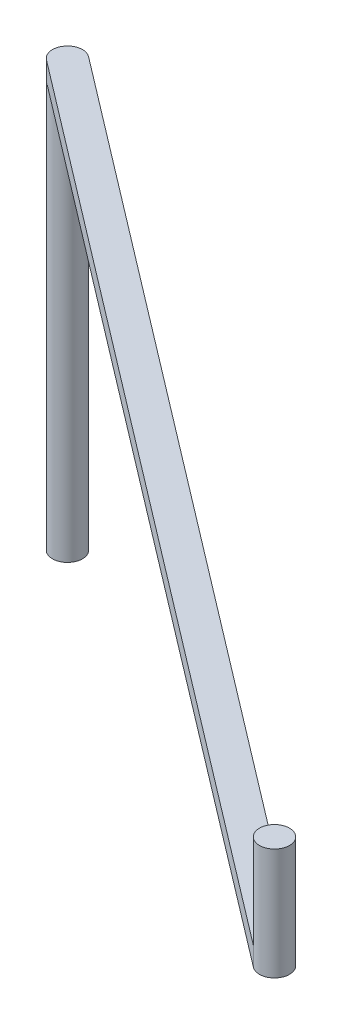
ISO-10303-21;
HEADER;
FILE_DESCRIPTION(('STEP AP214'),'2;1');
FILE_NAME('part.step','',(''),(''),'','','');
FILE_SCHEMA(('AUTOMOTIVE_DESIGN { 1 0 10303 214 1 1 1 1 }'));
ENDSEC;
DATA;
#1=APPLICATION_CONTEXT('core data for automotive mechanical design processes');
#2=APPLICATION_PROTOCOL_DEFINITION('international standard','automotive_design',2000,#1);
#3=PRODUCT_CONTEXT('',#1,'mechanical');
#4=PRODUCT('Part','Part','',(#3));
#5=PRODUCT_RELATED_PRODUCT_CATEGORY('part','',(#4));
#6=PRODUCT_DEFINITION_FORMATION('','',#4);
#7=PRODUCT_DEFINITION_CONTEXT('part definition',#1,'design');
#8=PRODUCT_DEFINITION('design','',#6,#7);
#9=PRODUCT_DEFINITION_SHAPE('','',#8);
#10=(LENGTH_UNIT() NAMED_UNIT(*) SI_UNIT(.MILLI.,.METRE.));
#11=(NAMED_UNIT(*) PLANE_ANGLE_UNIT() SI_UNIT($,.RADIAN.));
#12=(NAMED_UNIT(*) SI_UNIT($,.STERADIAN.) SOLID_ANGLE_UNIT());
#13=UNCERTAINTY_MEASURE_WITH_UNIT(LENGTH_MEASURE(1.E-05),#10,'distance_accuracy_value','');
#14=(GEOMETRIC_REPRESENTATION_CONTEXT(3) GLOBAL_UNCERTAINTY_ASSIGNED_CONTEXT((#13)) GLOBAL_UNIT_ASSIGNED_CONTEXT((#10,
#11,#12)) REPRESENTATION_CONTEXT('',''));
#15=CARTESIAN_POINT('',(0.,0.,0.));
#16=DIRECTION('',(0.,0.,1.));
#17=DIRECTION('',(1.,0.,0.));
#18=AXIS2_PLACEMENT_3D('',#15,#16,#17);
#19=CARTESIAN_POINT('',(1.67995279782915,-17.5908043356824,6.75346403648911));
#20=DIRECTION('',(0.,1.,0.));
#21=DIRECTION('',(-0.99979450619741,0.,0.0202717877228154));
#22=AXIS2_PLACEMENT_3D('',#19,#20,#21);
#23=PLANE('',#22);
#24=CARTESIAN_POINT('',(4.11481263415116,-17.5908043356824,22.3380316137882));
#25=DIRECTION('',(0.,1.,0.));
#26=DIRECTION('',(-1.,0.,0.));
#27=AXIS2_PLACEMENT_3D('',#24,#25,#26);
#28=CIRCLE('',#27,0.8);
#29=CARTESIAN_POINT('',(3.31481263415116,-17.5908043356824,22.3380316137882));
#30=VERTEX_POINT('',#29);
#31=EDGE_CURVE('E10',#30,#30,#28,.F.);
#32=ORIENTED_EDGE('',*,*,#31,.F.);
#33=EDGE_LOOP('',(#32));
#34=FACE_BOUND('',#33,.T.);
#35=ADVANCED_FACE('F16',(#34),#23,.T.);
#36=CARTESIAN_POINT('',(4.11481263415116,-17.5888043356824,22.3380316137882));
#37=DIRECTION('',(0.,-1.,0.));
#38=DIRECTION('',(1.,0.,0.));
#39=AXIS2_PLACEMENT_3D('',#36,#37,#38);
#40=CYLINDRICAL_SURFACE('',#39,0.8);
#41=CARTESIAN_POINT('',(4.11481263415116,-22.5408043356824,22.3380316137882));
#42=DIRECTION('',(0.,-1.,0.));
#43=DIRECTION('',(-0.7090944748072,0.,-0.705113484339862));
#44=AXIS2_PLACEMENT_3D('',#41,#42,#43);
#45=CIRCLE('',#44,0.8);
#46=CARTESIAN_POINT('',(3.62983961550808,-22.5408043356824,22.9742714830107));
#47=VERTEX_POINT('',#46);
#48=CARTESIAN_POINT('',(4.59978565279424,-22.5408043356824,21.7017917445657));
#49=VERTEX_POINT('',#48);
#50=EDGE_CURVE('E24',#47,#49,#45,.T.);
#51=ORIENTED_EDGE('',*,*,#50,.F.);
#52=DIRECTION('',(0.,1.,0.));
#53=VECTOR('',#52,1.);
#54=CARTESIAN_POINT('',(3.62983961550808,-23.5408043356823,22.9742714830107));
#55=LINE('',#54,#53);
#56=CARTESIAN_POINT('',(3.62983961550808,-23.5408043356823,22.9742714830107));
#57=VERTEX_POINT('',#56);
#58=EDGE_CURVE('E35',#57,#47,#55,.T.);
#59=ORIENTED_EDGE('',*,*,#58,.F.);
#60=CARTESIAN_POINT('',(4.11481263415116,-23.5408043356823,22.3380316137882));
#61=DIRECTION('',(0.,-1.,0.));
#62=DIRECTION('',(-0.7090944748072,0.,-0.705113484339862));
#63=AXIS2_PLACEMENT_3D('',#60,#61,#62);
#64=CIRCLE('',#63,0.8);
#65=CARTESIAN_POINT('',(4.59978565279424,-23.5408043356823,21.7017917445657));
#66=VERTEX_POINT('',#65);
#67=EDGE_CURVE('E73',#66,#57,#64,.T.);
#68=ORIENTED_EDGE('',*,*,#67,.F.);
#69=DIRECTION('',(0.,1.,0.));
#70=VECTOR('',#69,1.);
#71=CARTESIAN_POINT('',(4.59978565279424,-23.5408043356823,21.7017917445657));
#72=LINE('',#71,#70);
#73=EDGE_CURVE('E100',#66,#49,#72,.T.);
#74=ORIENTED_EDGE('',*,*,#73,.T.);
#75=EDGE_LOOP('',(#51,#59,#68,#74));
#76=FACE_BOUND('',#75,.T.);
#77=ORIENTED_EDGE('',*,*,#31,.T.);
#78=EDGE_LOOP('',(#77));
#79=FACE_BOUND('',#78,.T.);
#80=ADVANCED_FACE('F112',(#76,#79),#40,.T.);
#81=CARTESIAN_POINT('',(-18.9217983076755,-22.5408043356824,4.74022028454323));
#82=DIRECTION('',(0.,-1.,0.));
#83=DIRECTION('',(1.,0.,0.));
#84=AXIS2_PLACEMENT_3D('',#81,#82,#83);
#85=PLANE('',#84);
#86=DIRECTION('',(-0.795299836528086,0.,-0.606216273303843));
#87=VECTOR('',#86,1.);
#88=CARTESIAN_POINT('',(-19.564284816997,-22.5408043356824,5.29458008837741));
#89=LINE('',#88,#87);
#90=CARTESIAN_POINT('',(-42.7584092495022,-22.5408043356824,-12.3851113062559));
#91=VERTEX_POINT('',#90);
#92=EDGE_CURVE('E60',#47,#91,#89,.T.);
#93=ORIENTED_EDGE('',*,*,#92,.F.);
#94=ORIENTED_EDGE('',*,*,#50,.T.);
#95=DIRECTION('',(0.795299836528074,0.,0.606216273303859));
#96=VECTOR('',#95,1.);
#97=CARTESIAN_POINT('',(-18.5943387797105,-22.5408043356824,4.02210034993201));
#98=LINE('',#97,#96);
#99=CARTESIAN_POINT('',(-41.7884632122153,-22.5408043356824,-13.6575910447017));
#100=VERTEX_POINT('',#99);
#101=EDGE_CURVE('E95',#100,#49,#98,.T.);
#102=ORIENTED_EDGE('',*,*,#101,.F.);
#103=CARTESIAN_POINT('',(-42.2734362308587,-22.5408043356824,-13.0213511754788));
#104=DIRECTION('',(0.,-1.,0.));
#105=DIRECTION('',(1.,0.,0.));
#106=AXIS2_PLACEMENT_3D('',#103,#104,#105);
#107=CIRCLE('',#106,0.80000000000058);
#108=EDGE_CURVE('E92',#100,#91,#107,.F.);
#109=ORIENTED_EDGE('',*,*,#108,.T.);
#110=EDGE_LOOP('',(#93,#94,#102,#109));
#111=FACE_BOUND('',#110,.T.);
#112=ADVANCED_FACE('F108',(#111),#85,.F.);
#113=CARTESIAN_POINT('',(-18.5943387797105,-23.5408043356823,4.02210034993201));
#114=DIRECTION('',(-0.606216273303859,0.,0.795299836528074));
#115=DIRECTION('',(0.795299836528074,0.,0.606216273303859));
#116=AXIS2_PLACEMENT_3D('',#113,#114,#115);
#117=PLANE('',#116);
#118=ORIENTED_EDGE('',*,*,#101,.T.);
#119=ORIENTED_EDGE('',*,*,#73,.F.);
#120=DIRECTION('',(0.795299836528074,0.,0.606216273303859));
#121=VECTOR('',#120,1.);
#122=CARTESIAN_POINT('',(-18.5943387797105,-23.5408043356823,4.02210034993201));
#123=LINE('',#122,#121);
#124=CARTESIAN_POINT('',(-41.7884632122153,-23.5408043356823,-13.6575910447017));
#125=VERTEX_POINT('',#124);
#126=EDGE_CURVE('E89',#125,#66,#123,.T.);
#127=ORIENTED_EDGE('',*,*,#126,.F.);
#128=DIRECTION('',(0.,1.,0.));
#129=VECTOR('',#128,1.);
#130=CARTESIAN_POINT('',(-41.7884632122153,-23.5408043356823,-13.6575910447017));
#131=LINE('',#130,#129);
#132=EDGE_CURVE('E65',#125,#100,#131,.T.);
#133=ORIENTED_EDGE('',*,*,#132,.T.);
#134=EDGE_LOOP('',(#118,#119,#127,#133));
#135=FACE_BOUND('',#134,.T.);
#136=ADVANCED_FACE('F111',(#135),#117,.F.);
#137=CARTESIAN_POINT('',(-19.564284816997,-23.5408043356823,5.29458008837741));
#138=DIRECTION('',(0.606216273303843,0.,-0.795299836528086));
#139=DIRECTION('',(-0.795299836528086,0.,-0.606216273303843));
#140=AXIS2_PLACEMENT_3D('',#137,#138,#139);
#141=PLANE('',#140);
#142=ORIENTED_EDGE('',*,*,#92,.T.);
#143=DIRECTION('',(0.,1.,0.));
#144=VECTOR('',#143,1.);
#145=CARTESIAN_POINT('',(-42.7584092495022,-23.5408043356823,-12.3851113062559));
#146=LINE('',#145,#144);
#147=CARTESIAN_POINT('',(-42.7584092495022,-23.5408043356823,-12.3851113062559));
#148=VERTEX_POINT('',#147);
#149=EDGE_CURVE('E55',#148,#91,#146,.T.);
#150=ORIENTED_EDGE('',*,*,#149,.F.);
#151=DIRECTION('',(-0.795299836528086,0.,-0.606216273303843));
#152=VECTOR('',#151,1.);
#153=CARTESIAN_POINT('',(-19.564284816997,-23.5408043356823,5.29458008837741));
#154=LINE('',#153,#152);
#155=EDGE_CURVE('E58',#57,#148,#154,.T.);
#156=ORIENTED_EDGE('',*,*,#155,.F.);
#157=ORIENTED_EDGE('',*,*,#58,.T.);
#158=EDGE_LOOP('',(#142,#150,#156,#157));
#159=FACE_BOUND('',#158,.T.);
#160=ADVANCED_FACE('F57',(#159),#141,.F.);
#161=CARTESIAN_POINT('',(-18.9217983076755,-23.5408043356823,4.74022028454323));
#162=DIRECTION('',(0.,-1.,0.));
#163=DIRECTION('',(1.,0.,0.));
#164=AXIS2_PLACEMENT_3D('',#161,#162,#163);
#165=PLANE('',#164);
#166=CARTESIAN_POINT('',(-42.2734362308587,-23.5408043356823,-13.0213511754788));
#167=DIRECTION('',(0.,-1.,0.));
#168=DIRECTION('',(1.,0.,0.));
#169=AXIS2_PLACEMENT_3D('',#166,#167,#168);
#170=CIRCLE('',#169,0.80000000000058);
#171=EDGE_CURVE('E71',#125,#148,#170,.T.);
#172=ORIENTED_EDGE('',*,*,#171,.F.);
#173=ORIENTED_EDGE('',*,*,#126,.T.);
#174=ORIENTED_EDGE('',*,*,#67,.T.);
#175=ORIENTED_EDGE('',*,*,#155,.T.);
#176=EDGE_LOOP('',(#172,#173,#174,#175));
#177=FACE_BOUND('',#176,.T.);
#178=ADVANCED_FACE('F69',(#177),#165,.T.);
#179=CARTESIAN_POINT('',(-31.4644834936946,-45.2408043356824,14.0063644160256));
#180=DIRECTION('',(0.,0.999999999999984,0.));
#181=DIRECTION('',(0.203122960499166,0.,0.979153237710048));
#182=AXIS2_PLACEMENT_3D('',#179,#180,#181);
#183=PLANE('',#182);
#184=CARTESIAN_POINT('',(-42.2734362308587,-45.2408043356824,-13.0213511754788));
#185=DIRECTION('',(0.,1.,0.));
#186=DIRECTION('',(-1.,0.,0.));
#187=AXIS2_PLACEMENT_3D('',#184,#185,#186);
#188=CIRCLE('',#187,0.80000000000058);
#189=CARTESIAN_POINT('',(-43.0734362308593,-45.2408043356824,-13.0213511754788));
#190=VERTEX_POINT('',#189);
#191=EDGE_CURVE('E79',#190,#190,#188,.T.);
#192=ORIENTED_EDGE('',*,*,#191,.F.);
#193=EDGE_LOOP('',(#192));
#194=FACE_BOUND('',#193,.T.);
#195=ADVANCED_FACE('F147',(#194),#183,.F.);
#196=CARTESIAN_POINT('',(-42.2734362308587,-45.2428043356824,-13.0213511754788));
#197=DIRECTION('',(0.,1.,0.));
#198=DIRECTION('',(-1.,0.,0.));
#199=AXIS2_PLACEMENT_3D('',#196,#197,#198);
#200=CYLINDRICAL_SURFACE('',#199,0.80000000000058);
#201=ORIENTED_EDGE('',*,*,#191,.T.);
#202=EDGE_LOOP('',(#201));
#203=FACE_BOUND('',#202,.T.);
#204=ORIENTED_EDGE('',*,*,#171,.T.);
#205=ORIENTED_EDGE('',*,*,#149,.T.);
#206=ORIENTED_EDGE('',*,*,#108,.F.);
#207=ORIENTED_EDGE('',*,*,#132,.F.);
#208=EDGE_LOOP('',(#204,#205,#206,#207));
#209=FACE_BOUND('',#208,.T.);
#210=ADVANCED_FACE('F76',(#203,#209),#200,.T.);
#211=CLOSED_SHELL('',(#35,#80,#112,#136,#160,#178,#195,#210));
#212=MANIFOLD_SOLID_BREP('B1',#211);
#213=ADVANCED_BREP_SHAPE_REPRESENTATION('',(#18,#212),#14);
#214=SHAPE_DEFINITION_REPRESENTATION(#9,#213);
ENDSEC;
END-ISO-10303-21;
